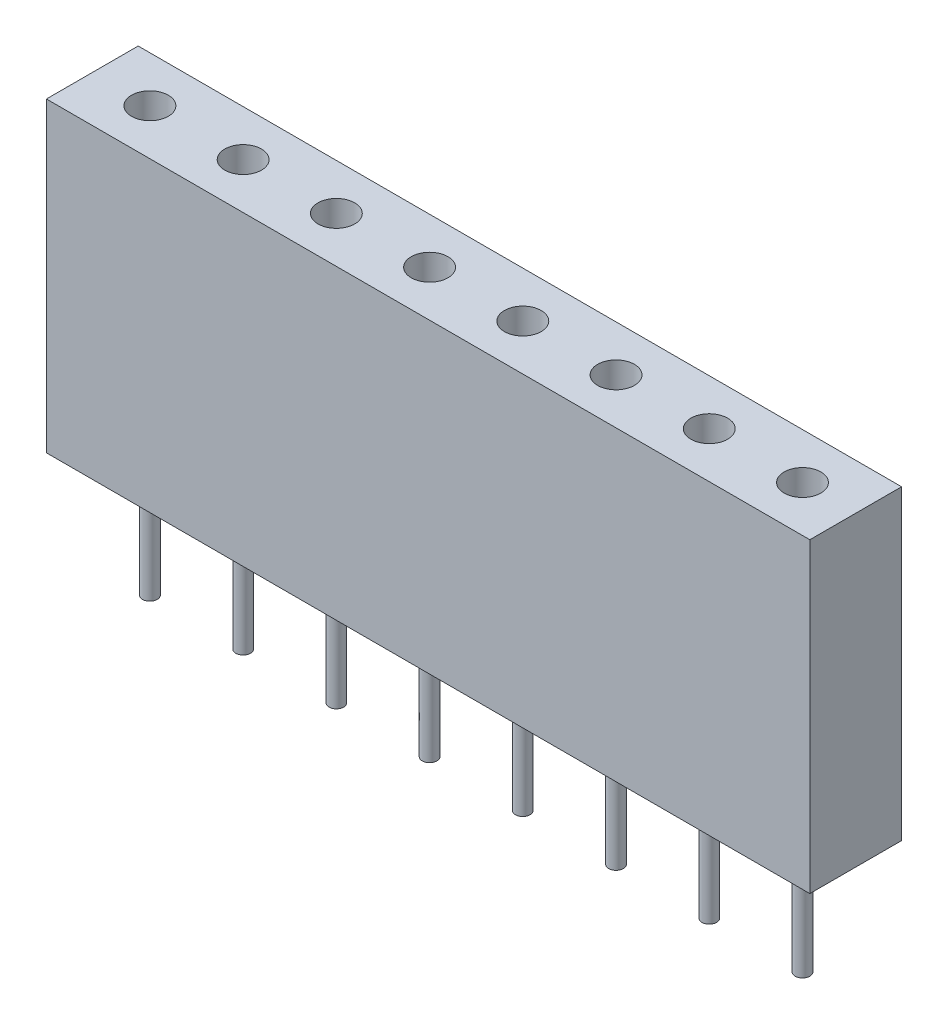
ISO-10303-21;
HEADER;
FILE_DESCRIPTION(('STEP AP214'),'2;1');
FILE_NAME('part.step','',(''),(''),'','','');
FILE_SCHEMA(('AUTOMOTIVE_DESIGN { 1 0 10303 214 1 1 1 1 }'));
ENDSEC;
DATA;
#1=APPLICATION_CONTEXT('core data for automotive mechanical design processes');
#2=APPLICATION_PROTOCOL_DEFINITION('international standard','automotive_design',2000,#1);
#3=PRODUCT_CONTEXT('',#1,'mechanical');
#4=PRODUCT('Part','Part','',(#3));
#5=PRODUCT_RELATED_PRODUCT_CATEGORY('part','',(#4));
#6=PRODUCT_DEFINITION_FORMATION('','',#4);
#7=PRODUCT_DEFINITION_CONTEXT('part definition',#1,'design');
#8=PRODUCT_DEFINITION('design','',#6,#7);
#9=PRODUCT_DEFINITION_SHAPE('','',#8);
#10=(LENGTH_UNIT() NAMED_UNIT(*) SI_UNIT(.MILLI.,.METRE.));
#11=(NAMED_UNIT(*) PLANE_ANGLE_UNIT() SI_UNIT($,.RADIAN.));
#12=(NAMED_UNIT(*) SI_UNIT($,.STERADIAN.) SOLID_ANGLE_UNIT());
#13=UNCERTAINTY_MEASURE_WITH_UNIT(LENGTH_MEASURE(1.E-05),#10,'distance_accuracy_value','');
#14=(GEOMETRIC_REPRESENTATION_CONTEXT(3) GLOBAL_UNCERTAINTY_ASSIGNED_CONTEXT((#13)) GLOBAL_UNIT_ASSIGNED_CONTEXT((#10,
#11,#12)) REPRESENTATION_CONTEXT('',''));
#15=CARTESIAN_POINT('',(0.,0.,0.));
#16=DIRECTION('',(0.,0.,1.));
#17=DIRECTION('',(1.,0.,0.));
#18=AXIS2_PLACEMENT_3D('',#15,#16,#17);
#19=CARTESIAN_POINT('',(10.4,8.35,1.25));
#20=DIRECTION('',(-1.,0.,0.));
#21=DIRECTION('',(0.,0.,1.));
#22=AXIS2_PLACEMENT_3D('',#19,#20,#21);
#23=PLANE('',#22);
#24=DIRECTION('',(0.,0.,-1.));
#25=VECTOR('',#24,1.);
#26=CARTESIAN_POINT('',(10.4,0.,1.25));
#27=LINE('',#26,#25);
#28=CARTESIAN_POINT('',(10.4,0.,1.25));
#29=VERTEX_POINT('',#28);
#30=CARTESIAN_POINT('',(10.4,0.,-1.25));
#31=VERTEX_POINT('',#30);
#32=EDGE_CURVE('E113',#29,#31,#27,.T.);
#33=ORIENTED_EDGE('',*,*,#32,.T.);
#34=DIRECTION('',(0.,-1.,0.));
#35=VECTOR('',#34,1.);
#36=CARTESIAN_POINT('',(10.4,8.35,-1.25));
#37=LINE('',#36,#35);
#38=CARTESIAN_POINT('',(10.4,8.35,-1.25));
#39=VERTEX_POINT('',#38);
#40=EDGE_CURVE('E11',#39,#31,#37,.T.);
#41=ORIENTED_EDGE('',*,*,#40,.F.);
#42=DIRECTION('',(0.,0.,-1.));
#43=VECTOR('',#42,1.);
#44=CARTESIAN_POINT('',(10.4,8.35,1.25));
#45=LINE('',#44,#43);
#46=CARTESIAN_POINT('',(10.4,8.35,1.25));
#47=VERTEX_POINT('',#46);
#48=EDGE_CURVE('E97',#47,#39,#45,.T.);
#49=ORIENTED_EDGE('',*,*,#48,.F.);
#50=DIRECTION('',(0.,-1.,0.));
#51=VECTOR('',#50,1.);
#52=CARTESIAN_POINT('',(10.4,8.35,1.25));
#53=LINE('',#52,#51);
#54=EDGE_CURVE('E109',#47,#29,#53,.T.);
#55=ORIENTED_EDGE('',*,*,#54,.T.);
#56=EDGE_LOOP('',(#33,#41,#49,#55));
#57=FACE_BOUND('',#56,.T.);
#58=ADVANCED_FACE('F45',(#57),#23,.F.);
#59=CARTESIAN_POINT('',(-10.4,8.35,-1.25));
#60=DIRECTION('',(0.,0.,1.));
#61=DIRECTION('',(1.,0.,0.));
#62=AXIS2_PLACEMENT_3D('',#59,#60,#61);
#63=PLANE('',#62);
#64=DIRECTION('',(-1.,0.,0.));
#65=VECTOR('',#64,1.);
#66=CARTESIAN_POINT('',(-10.4,0.,-1.25));
#67=LINE('',#66,#65);
#68=CARTESIAN_POINT('',(-10.4,0.,-1.25));
#69=VERTEX_POINT('',#68);
#70=EDGE_CURVE('E102',#31,#69,#67,.T.);
#71=ORIENTED_EDGE('',*,*,#70,.T.);
#72=DIRECTION('',(0.,-1.,0.));
#73=VECTOR('',#72,1.);
#74=CARTESIAN_POINT('',(-10.4,8.35,-1.25));
#75=LINE('',#74,#73);
#76=CARTESIAN_POINT('',(-10.4,8.35,-1.25));
#77=VERTEX_POINT('',#76);
#78=EDGE_CURVE('E54',#77,#69,#75,.T.);
#79=ORIENTED_EDGE('',*,*,#78,.F.);
#80=DIRECTION('',(-1.,0.,0.));
#81=VECTOR('',#80,1.);
#82=CARTESIAN_POINT('',(-10.4,8.35,-1.25));
#83=LINE('',#82,#81);
#84=EDGE_CURVE('E92',#39,#77,#83,.T.);
#85=ORIENTED_EDGE('',*,*,#84,.F.);
#86=ORIENTED_EDGE('',*,*,#40,.T.);
#87=EDGE_LOOP('',(#71,#79,#85,#86));
#88=FACE_BOUND('',#87,.T.);
#89=ADVANCED_FACE('F101',(#88),#63,.F.);
#90=CARTESIAN_POINT('',(-10.4,8.35,1.25));
#91=DIRECTION('',(1.,0.,0.));
#92=DIRECTION('',(0.,0.,-1.));
#93=AXIS2_PLACEMENT_3D('',#90,#91,#92);
#94=PLANE('',#93);
#95=DIRECTION('',(0.,0.,1.));
#96=VECTOR('',#95,1.);
#97=CARTESIAN_POINT('',(-10.4,0.,1.25));
#98=LINE('',#97,#96);
#99=CARTESIAN_POINT('',(-10.4,0.,1.25));
#100=VERTEX_POINT('',#99);
#101=EDGE_CURVE('E79',#69,#100,#98,.T.);
#102=ORIENTED_EDGE('',*,*,#101,.T.);
#103=DIRECTION('',(0.,-1.,0.));
#104=VECTOR('',#103,1.);
#105=CARTESIAN_POINT('',(-10.4,8.35,1.25));
#106=LINE('',#105,#104);
#107=CARTESIAN_POINT('',(-10.4,8.35,1.25));
#108=VERTEX_POINT('',#107);
#109=EDGE_CURVE('E104',#108,#100,#106,.T.);
#110=ORIENTED_EDGE('',*,*,#109,.F.);
#111=DIRECTION('',(0.,0.,1.));
#112=VECTOR('',#111,1.);
#113=CARTESIAN_POINT('',(-10.4,8.35,1.25));
#114=LINE('',#113,#112);
#115=EDGE_CURVE('E95',#77,#108,#114,.T.);
#116=ORIENTED_EDGE('',*,*,#115,.F.);
#117=ORIENTED_EDGE('',*,*,#78,.T.);
#118=EDGE_LOOP('',(#102,#110,#116,#117));
#119=FACE_BOUND('',#118,.T.);
#120=ADVANCED_FACE('F105',(#119),#94,.F.);
#121=CARTESIAN_POINT('',(-10.4,8.35,1.25));
#122=DIRECTION('',(0.,0.,-1.));
#123=DIRECTION('',(-1.,0.,0.));
#124=AXIS2_PLACEMENT_3D('',#121,#122,#123);
#125=PLANE('',#124);
#126=DIRECTION('',(1.,0.,0.));
#127=VECTOR('',#126,1.);
#128=CARTESIAN_POINT('',(-10.4,0.,1.25));
#129=LINE('',#128,#127);
#130=EDGE_CURVE('E85',#100,#29,#129,.T.);
#131=ORIENTED_EDGE('',*,*,#130,.T.);
#132=ORIENTED_EDGE('',*,*,#54,.F.);
#133=DIRECTION('',(1.,0.,0.));
#134=VECTOR('',#133,1.);
#135=CARTESIAN_POINT('',(-10.4,8.35,1.25));
#136=LINE('',#135,#134);
#137=EDGE_CURVE('E62',#108,#47,#136,.T.);
#138=ORIENTED_EDGE('',*,*,#137,.F.);
#139=ORIENTED_EDGE('',*,*,#109,.T.);
#140=EDGE_LOOP('',(#131,#132,#138,#139));
#141=FACE_BOUND('',#140,.T.);
#142=ADVANCED_FACE('F127',(#141),#125,.F.);
#143=CARTESIAN_POINT('',(0.,8.35,0.));
#144=DIRECTION('',(0.,-1.,0.));
#145=DIRECTION('',(0.,0.,-1.));
#146=AXIS2_PLACEMENT_3D('',#143,#144,#145);
#147=PLANE('',#146);
#148=CARTESIAN_POINT('',(8.95,8.35,0.));
#149=DIRECTION('',(0.,1.,0.));
#150=DIRECTION('',(0.,0.,1.));
#151=AXIS2_PLACEMENT_3D('',#148,#149,#150);
#152=CIRCLE('',#151,0.500000000000001);
#153=CARTESIAN_POINT('',(8.95,8.35,0.500000000000001));
#154=VERTEX_POINT('',#153);
#155=EDGE_CURVE('E201',#154,#154,#152,.T.);
#156=ORIENTED_EDGE('',*,*,#155,.F.);
#157=EDGE_LOOP('',(#156));
#158=FACE_BOUND('',#157,.T.);
#159=CARTESIAN_POINT('',(6.41,8.35,0.));
#160=DIRECTION('',(0.,1.,0.));
#161=DIRECTION('',(0.,0.,1.));
#162=AXIS2_PLACEMENT_3D('',#159,#160,#161);
#163=CIRCLE('',#162,0.500000000000001);
#164=CARTESIAN_POINT('',(6.41,8.35,0.500000000000001));
#165=VERTEX_POINT('',#164);
#166=EDGE_CURVE('E193',#165,#165,#163,.T.);
#167=ORIENTED_EDGE('',*,*,#166,.F.);
#168=EDGE_LOOP('',(#167));
#169=FACE_BOUND('',#168,.T.);
#170=CARTESIAN_POINT('',(3.87000000000001,8.35,0.));
#171=DIRECTION('',(0.,1.,0.));
#172=DIRECTION('',(0.,0.,1.));
#173=AXIS2_PLACEMENT_3D('',#170,#171,#172);
#174=CIRCLE('',#173,0.500000000000001);
#175=CARTESIAN_POINT('',(3.87000000000001,8.35,0.500000000000001));
#176=VERTEX_POINT('',#175);
#177=EDGE_CURVE('E185',#176,#176,#174,.T.);
#178=ORIENTED_EDGE('',*,*,#177,.F.);
#179=EDGE_LOOP('',(#178));
#180=FACE_BOUND('',#179,.T.);
#181=CARTESIAN_POINT('',(1.33,8.35,0.));
#182=DIRECTION('',(0.,1.,0.));
#183=DIRECTION('',(0.,0.,1.));
#184=AXIS2_PLACEMENT_3D('',#181,#182,#183);
#185=CIRCLE('',#184,0.500000000000001);
#186=CARTESIAN_POINT('',(1.33,8.35,0.500000000000001));
#187=VERTEX_POINT('',#186);
#188=EDGE_CURVE('E177',#187,#187,#185,.T.);
#189=ORIENTED_EDGE('',*,*,#188,.F.);
#190=EDGE_LOOP('',(#189));
#191=FACE_BOUND('',#190,.T.);
#192=CARTESIAN_POINT('',(-1.21,8.35,0.));
#193=DIRECTION('',(0.,1.,0.));
#194=DIRECTION('',(0.,0.,1.));
#195=AXIS2_PLACEMENT_3D('',#192,#193,#194);
#196=CIRCLE('',#195,0.500000000000001);
#197=CARTESIAN_POINT('',(-1.21,8.35,0.500000000000001));
#198=VERTEX_POINT('',#197);
#199=EDGE_CURVE('E169',#198,#198,#196,.T.);
#200=ORIENTED_EDGE('',*,*,#199,.F.);
#201=EDGE_LOOP('',(#200));
#202=FACE_BOUND('',#201,.T.);
#203=CARTESIAN_POINT('',(-3.75,8.35,0.));
#204=DIRECTION('',(0.,1.,0.));
#205=DIRECTION('',(0.,0.,1.));
#206=AXIS2_PLACEMENT_3D('',#203,#204,#205);
#207=CIRCLE('',#206,0.500000000000001);
#208=CARTESIAN_POINT('',(-3.75,8.35,0.500000000000001));
#209=VERTEX_POINT('',#208);
#210=EDGE_CURVE('E161',#209,#209,#207,.T.);
#211=ORIENTED_EDGE('',*,*,#210,.F.);
#212=EDGE_LOOP('',(#211));
#213=FACE_BOUND('',#212,.T.);
#214=CARTESIAN_POINT('',(-6.29,8.35,0.));
#215=DIRECTION('',(0.,1.,0.));
#216=DIRECTION('',(0.,0.,1.));
#217=AXIS2_PLACEMENT_3D('',#214,#215,#216);
#218=CIRCLE('',#217,0.500000000000001);
#219=CARTESIAN_POINT('',(-6.29,8.35,0.500000000000001));
#220=VERTEX_POINT('',#219);
#221=EDGE_CURVE('E153',#220,#220,#218,.T.);
#222=ORIENTED_EDGE('',*,*,#221,.F.);
#223=EDGE_LOOP('',(#222));
#224=FACE_BOUND('',#223,.T.);
#225=CARTESIAN_POINT('',(-8.83,8.35,0.));
#226=DIRECTION('',(0.,1.,0.));
#227=DIRECTION('',(0.,0.,1.));
#228=AXIS2_PLACEMENT_3D('',#225,#226,#227);
#229=CIRCLE('',#228,0.500000000000001);
#230=CARTESIAN_POINT('',(-8.83,8.35,0.500000000000001));
#231=VERTEX_POINT('',#230);
#232=EDGE_CURVE('E134',#231,#231,#229,.T.);
#233=ORIENTED_EDGE('',*,*,#232,.F.);
#234=EDGE_LOOP('',(#233));
#235=FACE_BOUND('',#234,.T.);
#236=ORIENTED_EDGE('',*,*,#48,.T.);
#237=ORIENTED_EDGE('',*,*,#84,.T.);
#238=ORIENTED_EDGE('',*,*,#115,.T.);
#239=ORIENTED_EDGE('',*,*,#137,.T.);
#240=EDGE_LOOP('',(#236,#237,#238,#239));
#241=FACE_BOUND('',#240,.T.);
#242=ADVANCED_FACE('F93',(#158,#169,#180,#191,#202,#213,#224,#235,#241),#147,.F.);
#243=CARTESIAN_POINT('',(0.,0.,0.));
#244=DIRECTION('',(0.,-1.,0.));
#245=DIRECTION('',(0.,0.,-1.));
#246=AXIS2_PLACEMENT_3D('',#243,#244,#245);
#247=PLANE('',#246);
#248=CARTESIAN_POINT('',(8.95,0.,0.));
#249=DIRECTION('',(0.,-1.,0.));
#250=DIRECTION('',(0.,0.,-1.));
#251=AXIS2_PLACEMENT_3D('',#248,#249,#250);
#252=CIRCLE('',#251,0.200000000000001);
#253=CARTESIAN_POINT('',(8.95,0.,-0.200000000000001));
#254=VERTEX_POINT('',#253);
#255=EDGE_CURVE('E254',#254,#254,#252,.T.);
#256=ORIENTED_EDGE('',*,*,#255,.F.);
#257=EDGE_LOOP('',(#256));
#258=FACE_BOUND('',#257,.T.);
#259=CARTESIAN_POINT('',(6.41,0.,0.));
#260=DIRECTION('',(0.,-1.,0.));
#261=DIRECTION('',(0.,0.,-1.));
#262=AXIS2_PLACEMENT_3D('',#259,#260,#261);
#263=CIRCLE('',#262,0.200000000000001);
#264=CARTESIAN_POINT('',(6.41,0.,-0.200000000000001));
#265=VERTEX_POINT('',#264);
#266=EDGE_CURVE('E246',#265,#265,#263,.T.);
#267=ORIENTED_EDGE('',*,*,#266,.F.);
#268=EDGE_LOOP('',(#267));
#269=FACE_BOUND('',#268,.T.);
#270=CARTESIAN_POINT('',(3.87000000000001,0.,0.));
#271=DIRECTION('',(0.,-1.,0.));
#272=DIRECTION('',(0.,0.,-1.));
#273=AXIS2_PLACEMENT_3D('',#270,#271,#272);
#274=CIRCLE('',#273,0.200000000000001);
#275=CARTESIAN_POINT('',(3.87000000000001,0.,-0.200000000000001));
#276=VERTEX_POINT('',#275);
#277=EDGE_CURVE('E238',#276,#276,#274,.T.);
#278=ORIENTED_EDGE('',*,*,#277,.F.);
#279=EDGE_LOOP('',(#278));
#280=FACE_BOUND('',#279,.T.);
#281=CARTESIAN_POINT('',(1.33,0.,0.));
#282=DIRECTION('',(0.,-1.,0.));
#283=DIRECTION('',(0.,0.,-1.));
#284=AXIS2_PLACEMENT_3D('',#281,#282,#283);
#285=CIRCLE('',#284,0.200000000000001);
#286=CARTESIAN_POINT('',(1.33,0.,-0.200000000000001));
#287=VERTEX_POINT('',#286);
#288=EDGE_CURVE('E230',#287,#287,#285,.T.);
#289=ORIENTED_EDGE('',*,*,#288,.F.);
#290=EDGE_LOOP('',(#289));
#291=FACE_BOUND('',#290,.T.);
#292=CARTESIAN_POINT('',(-1.21,0.,0.));
#293=DIRECTION('',(0.,-1.,0.));
#294=DIRECTION('',(0.,0.,-1.));
#295=AXIS2_PLACEMENT_3D('',#292,#293,#294);
#296=CIRCLE('',#295,0.200000000000001);
#297=CARTESIAN_POINT('',(-1.21,0.,-0.200000000000001));
#298=VERTEX_POINT('',#297);
#299=EDGE_CURVE('E222',#298,#298,#296,.T.);
#300=ORIENTED_EDGE('',*,*,#299,.F.);
#301=EDGE_LOOP('',(#300));
#302=FACE_BOUND('',#301,.T.);
#303=CARTESIAN_POINT('',(-3.75,0.,0.));
#304=DIRECTION('',(0.,-1.,0.));
#305=DIRECTION('',(0.,0.,-1.));
#306=AXIS2_PLACEMENT_3D('',#303,#304,#305);
#307=CIRCLE('',#306,0.200000000000001);
#308=CARTESIAN_POINT('',(-3.75,0.,-0.200000000000001));
#309=VERTEX_POINT('',#308);
#310=EDGE_CURVE('E214',#309,#309,#307,.T.);
#311=ORIENTED_EDGE('',*,*,#310,.F.);
#312=EDGE_LOOP('',(#311));
#313=FACE_BOUND('',#312,.T.);
#314=CARTESIAN_POINT('',(-6.29,0.,0.));
#315=DIRECTION('',(0.,-1.,0.));
#316=DIRECTION('',(0.,0.,-1.));
#317=AXIS2_PLACEMENT_3D('',#314,#315,#316);
#318=CIRCLE('',#317,0.200000000000001);
#319=CARTESIAN_POINT('',(-6.29,0.,-0.200000000000001));
#320=VERTEX_POINT('',#319);
#321=EDGE_CURVE('E206',#320,#320,#318,.T.);
#322=ORIENTED_EDGE('',*,*,#321,.F.);
#323=EDGE_LOOP('',(#322));
#324=FACE_BOUND('',#323,.T.);
#325=CARTESIAN_POINT('',(-8.83,0.,0.));
#326=DIRECTION('',(0.,-1.,0.));
#327=DIRECTION('',(0.,0.,-1.));
#328=AXIS2_PLACEMENT_3D('',#325,#326,#327);
#329=CIRCLE('',#328,0.200000000000001);
#330=CARTESIAN_POINT('',(-8.83,0.,-0.200000000000001));
#331=VERTEX_POINT('',#330);
#332=EDGE_CURVE('E142',#331,#331,#329,.T.);
#333=ORIENTED_EDGE('',*,*,#332,.F.);
#334=EDGE_LOOP('',(#333));
#335=FACE_BOUND('',#334,.T.);
#336=ORIENTED_EDGE('',*,*,#32,.F.);
#337=ORIENTED_EDGE('',*,*,#130,.F.);
#338=ORIENTED_EDGE('',*,*,#101,.F.);
#339=ORIENTED_EDGE('',*,*,#70,.F.);
#340=EDGE_LOOP('',(#336,#337,#338,#339));
#341=FACE_BOUND('',#340,.T.);
#342=ADVANCED_FACE('F130',(#258,#269,#280,#291,#302,#313,#324,#335,#341),#247,.T.);
#343=CARTESIAN_POINT('',(-8.83,5.35,0.));
#344=DIRECTION('',(0.,1.,0.));
#345=DIRECTION('',(0.,0.,1.));
#346=AXIS2_PLACEMENT_3D('',#343,#344,#345);
#347=CYLINDRICAL_SURFACE('',#346,0.500000000000001);
#348=CARTESIAN_POINT('',(-8.83,5.35,0.));
#349=DIRECTION('',(0.,1.,0.));
#350=DIRECTION('',(0.,0.,1.));
#351=AXIS2_PLACEMENT_3D('',#348,#349,#350);
#352=CIRCLE('',#351,0.500000000000001);
#353=CARTESIAN_POINT('',(-8.83,5.35,0.500000000000001));
#354=VERTEX_POINT('',#353);
#355=EDGE_CURVE('E117',#354,#354,#352,.T.);
#356=ORIENTED_EDGE('',*,*,#355,.F.);
#357=EDGE_LOOP('',(#356));
#358=FACE_BOUND('',#357,.T.);
#359=ORIENTED_EDGE('',*,*,#232,.T.);
#360=EDGE_LOOP('',(#359));
#361=FACE_BOUND('',#360,.T.);
#362=ADVANCED_FACE('F273',(#358,#361),#347,.F.);
#363=CARTESIAN_POINT('',(-8.83,5.35,0.));
#364=DIRECTION('',(0.,1.,0.));
#365=DIRECTION('',(0.,0.,1.));
#366=AXIS2_PLACEMENT_3D('',#363,#364,#365);
#367=PLANE('',#366);
#368=ORIENTED_EDGE('',*,*,#355,.T.);
#369=EDGE_LOOP('',(#368));
#370=FACE_BOUND('',#369,.T.);
#371=ADVANCED_FACE('F292',(#370),#367,.T.);
#372=CARTESIAN_POINT('',(-8.83,-3.2,0.));
#373=DIRECTION('',(0.,1.,0.));
#374=DIRECTION('',(0.,0.,1.));
#375=AXIS2_PLACEMENT_3D('',#372,#373,#374);
#376=CYLINDRICAL_SURFACE('',#375,0.200000000000001);
#377=CARTESIAN_POINT('',(-8.83,-3.2,0.));
#378=DIRECTION('',(0.,-1.,0.));
#379=DIRECTION('',(0.,0.,-1.));
#380=AXIS2_PLACEMENT_3D('',#377,#378,#379);
#381=CIRCLE('',#380,0.200000000000001);
#382=CARTESIAN_POINT('',(-8.83,-3.2,-0.200000000000001));
#383=VERTEX_POINT('',#382);
#384=EDGE_CURVE('E138',#383,#383,#381,.T.);
#385=ORIENTED_EDGE('',*,*,#384,.F.);
#386=EDGE_LOOP('',(#385));
#387=FACE_BOUND('',#386,.T.);
#388=ORIENTED_EDGE('',*,*,#332,.T.);
#389=EDGE_LOOP('',(#388));
#390=FACE_BOUND('',#389,.T.);
#391=ADVANCED_FACE('F289',(#387,#390),#376,.T.);
#392=CARTESIAN_POINT('',(-8.83,-3.2,0.));
#393=DIRECTION('',(0.,-1.,0.));
#394=DIRECTION('',(0.,0.,-1.));
#395=AXIS2_PLACEMENT_3D('',#392,#393,#394);
#396=PLANE('',#395);
#397=ORIENTED_EDGE('',*,*,#384,.T.);
#398=EDGE_LOOP('',(#397));
#399=FACE_BOUND('',#398,.T.);
#400=ADVANCED_FACE('F291',(#399),#396,.T.);
#401=CARTESIAN_POINT('',(-6.29,5.35,0.));
#402=DIRECTION('',(0.,1.,0.));
#403=DIRECTION('',(0.,0.,1.));
#404=AXIS2_PLACEMENT_3D('',#401,#402,#403);
#405=CYLINDRICAL_SURFACE('',#404,0.500000000000001);
#406=CARTESIAN_POINT('',(-6.29,5.35,0.));
#407=DIRECTION('',(0.,1.,0.));
#408=DIRECTION('',(0.,0.,1.));
#409=AXIS2_PLACEMENT_3D('',#406,#407,#408);
#410=CIRCLE('',#409,0.500000000000001);
#411=CARTESIAN_POINT('',(-6.29,5.35,0.500000000000001));
#412=VERTEX_POINT('',#411);
#413=EDGE_CURVE('E146',#412,#412,#410,.T.);
#414=ORIENTED_EDGE('',*,*,#413,.F.);
#415=EDGE_LOOP('',(#414));
#416=FACE_BOUND('',#415,.T.);
#417=ORIENTED_EDGE('',*,*,#221,.T.);
#418=EDGE_LOOP('',(#417));
#419=FACE_BOUND('',#418,.T.);
#420=ADVANCED_FACE('F299',(#416,#419),#405,.F.);
#421=CARTESIAN_POINT('',(-6.29,5.35,0.));
#422=DIRECTION('',(0.,1.,0.));
#423=DIRECTION('',(0.,0.,1.));
#424=AXIS2_PLACEMENT_3D('',#421,#422,#423);
#425=PLANE('',#424);
#426=ORIENTED_EDGE('',*,*,#413,.T.);
#427=EDGE_LOOP('',(#426));
#428=FACE_BOUND('',#427,.T.);
#429=ADVANCED_FACE('F355',(#428),#425,.T.);
#430=CARTESIAN_POINT('',(-3.75,5.35,0.));
#431=DIRECTION('',(0.,1.,0.));
#432=DIRECTION('',(0.,0.,1.));
#433=AXIS2_PLACEMENT_3D('',#430,#431,#432);
#434=CYLINDRICAL_SURFACE('',#433,0.500000000000001);
#435=CARTESIAN_POINT('',(-3.75,5.35,0.));
#436=DIRECTION('',(0.,1.,0.));
#437=DIRECTION('',(0.,0.,1.));
#438=AXIS2_PLACEMENT_3D('',#435,#436,#437);
#439=CIRCLE('',#438,0.500000000000001);
#440=CARTESIAN_POINT('',(-3.75,5.35,0.500000000000001));
#441=VERTEX_POINT('',#440);
#442=EDGE_CURVE('E157',#441,#441,#439,.T.);
#443=ORIENTED_EDGE('',*,*,#442,.F.);
#444=EDGE_LOOP('',(#443));
#445=FACE_BOUND('',#444,.T.);
#446=ORIENTED_EDGE('',*,*,#210,.T.);
#447=EDGE_LOOP('',(#446));
#448=FACE_BOUND('',#447,.T.);
#449=ADVANCED_FACE('F365',(#445,#448),#434,.F.);
#450=CARTESIAN_POINT('',(-3.75,5.35,0.));
#451=DIRECTION('',(0.,1.,0.));
#452=DIRECTION('',(0.,0.,1.));
#453=AXIS2_PLACEMENT_3D('',#450,#451,#452);
#454=PLANE('',#453);
#455=ORIENTED_EDGE('',*,*,#442,.T.);
#456=EDGE_LOOP('',(#455));
#457=FACE_BOUND('',#456,.T.);
#458=ADVANCED_FACE('F375',(#457),#454,.T.);
#459=CARTESIAN_POINT('',(-1.21,5.35,0.));
#460=DIRECTION('',(0.,1.,0.));
#461=DIRECTION('',(0.,0.,1.));
#462=AXIS2_PLACEMENT_3D('',#459,#460,#461);
#463=CYLINDRICAL_SURFACE('',#462,0.500000000000001);
#464=CARTESIAN_POINT('',(-1.21,5.35,0.));
#465=DIRECTION('',(0.,1.,0.));
#466=DIRECTION('',(0.,0.,1.));
#467=AXIS2_PLACEMENT_3D('',#464,#465,#466);
#468=CIRCLE('',#467,0.500000000000001);
#469=CARTESIAN_POINT('',(-1.21,5.35,0.500000000000001));
#470=VERTEX_POINT('',#469);
#471=EDGE_CURVE('E165',#470,#470,#468,.T.);
#472=ORIENTED_EDGE('',*,*,#471,.F.);
#473=EDGE_LOOP('',(#472));
#474=FACE_BOUND('',#473,.T.);
#475=ORIENTED_EDGE('',*,*,#199,.T.);
#476=EDGE_LOOP('',(#475));
#477=FACE_BOUND('',#476,.T.);
#478=ADVANCED_FACE('F385',(#474,#477),#463,.F.);
#479=CARTESIAN_POINT('',(-1.21,5.35,0.));
#480=DIRECTION('',(0.,1.,0.));
#481=DIRECTION('',(0.,0.,1.));
#482=AXIS2_PLACEMENT_3D('',#479,#480,#481);
#483=PLANE('',#482);
#484=ORIENTED_EDGE('',*,*,#471,.T.);
#485=EDGE_LOOP('',(#484));
#486=FACE_BOUND('',#485,.T.);
#487=ADVANCED_FACE('F395',(#486),#483,.T.);
#488=CARTESIAN_POINT('',(1.33,5.35,0.));
#489=DIRECTION('',(0.,1.,0.));
#490=DIRECTION('',(0.,0.,1.));
#491=AXIS2_PLACEMENT_3D('',#488,#489,#490);
#492=CYLINDRICAL_SURFACE('',#491,0.500000000000001);
#493=CARTESIAN_POINT('',(1.33,5.35,0.));
#494=DIRECTION('',(0.,1.,0.));
#495=DIRECTION('',(0.,0.,1.));
#496=AXIS2_PLACEMENT_3D('',#493,#494,#495);
#497=CIRCLE('',#496,0.500000000000001);
#498=CARTESIAN_POINT('',(1.33,5.35,0.500000000000001));
#499=VERTEX_POINT('',#498);
#500=EDGE_CURVE('E173',#499,#499,#497,.T.);
#501=ORIENTED_EDGE('',*,*,#500,.F.);
#502=EDGE_LOOP('',(#501));
#503=FACE_BOUND('',#502,.T.);
#504=ORIENTED_EDGE('',*,*,#188,.T.);
#505=EDGE_LOOP('',(#504));
#506=FACE_BOUND('',#505,.T.);
#507=ADVANCED_FACE('F405',(#503,#506),#492,.F.);
#508=CARTESIAN_POINT('',(1.33,5.35,0.));
#509=DIRECTION('',(0.,1.,0.));
#510=DIRECTION('',(0.,0.,1.));
#511=AXIS2_PLACEMENT_3D('',#508,#509,#510);
#512=PLANE('',#511);
#513=ORIENTED_EDGE('',*,*,#500,.T.);
#514=EDGE_LOOP('',(#513));
#515=FACE_BOUND('',#514,.T.);
#516=ADVANCED_FACE('F415',(#515),#512,.T.);
#517=CARTESIAN_POINT('',(3.87000000000001,5.35,0.));
#518=DIRECTION('',(0.,1.,0.));
#519=DIRECTION('',(0.,0.,1.));
#520=AXIS2_PLACEMENT_3D('',#517,#518,#519);
#521=CYLINDRICAL_SURFACE('',#520,0.500000000000001);
#522=CARTESIAN_POINT('',(3.87000000000001,5.35,0.));
#523=DIRECTION('',(0.,1.,0.));
#524=DIRECTION('',(0.,0.,1.));
#525=AXIS2_PLACEMENT_3D('',#522,#523,#524);
#526=CIRCLE('',#525,0.500000000000001);
#527=CARTESIAN_POINT('',(3.87000000000001,5.35,0.500000000000001));
#528=VERTEX_POINT('',#527);
#529=EDGE_CURVE('E181',#528,#528,#526,.T.);
#530=ORIENTED_EDGE('',*,*,#529,.F.);
#531=EDGE_LOOP('',(#530));
#532=FACE_BOUND('',#531,.T.);
#533=ORIENTED_EDGE('',*,*,#177,.T.);
#534=EDGE_LOOP('',(#533));
#535=FACE_BOUND('',#534,.T.);
#536=ADVANCED_FACE('F425',(#532,#535),#521,.F.);
#537=CARTESIAN_POINT('',(3.87000000000001,5.35,0.));
#538=DIRECTION('',(0.,1.,0.));
#539=DIRECTION('',(0.,0.,1.));
#540=AXIS2_PLACEMENT_3D('',#537,#538,#539);
#541=PLANE('',#540);
#542=ORIENTED_EDGE('',*,*,#529,.T.);
#543=EDGE_LOOP('',(#542));
#544=FACE_BOUND('',#543,.T.);
#545=ADVANCED_FACE('F435',(#544),#541,.T.);
#546=CARTESIAN_POINT('',(6.41,5.35,0.));
#547=DIRECTION('',(0.,1.,0.));
#548=DIRECTION('',(0.,0.,1.));
#549=AXIS2_PLACEMENT_3D('',#546,#547,#548);
#550=CYLINDRICAL_SURFACE('',#549,0.500000000000001);
#551=CARTESIAN_POINT('',(6.41,5.35,0.));
#552=DIRECTION('',(0.,1.,0.));
#553=DIRECTION('',(0.,0.,1.));
#554=AXIS2_PLACEMENT_3D('',#551,#552,#553);
#555=CIRCLE('',#554,0.500000000000001);
#556=CARTESIAN_POINT('',(6.41,5.35,0.500000000000001));
#557=VERTEX_POINT('',#556);
#558=EDGE_CURVE('E189',#557,#557,#555,.T.);
#559=ORIENTED_EDGE('',*,*,#558,.F.);
#560=EDGE_LOOP('',(#559));
#561=FACE_BOUND('',#560,.T.);
#562=ORIENTED_EDGE('',*,*,#166,.T.);
#563=EDGE_LOOP('',(#562));
#564=FACE_BOUND('',#563,.T.);
#565=ADVANCED_FACE('F445',(#561,#564),#550,.F.);
#566=CARTESIAN_POINT('',(6.41,5.35,0.));
#567=DIRECTION('',(0.,1.,0.));
#568=DIRECTION('',(0.,0.,1.));
#569=AXIS2_PLACEMENT_3D('',#566,#567,#568);
#570=PLANE('',#569);
#571=ORIENTED_EDGE('',*,*,#558,.T.);
#572=EDGE_LOOP('',(#571));
#573=FACE_BOUND('',#572,.T.);
#574=ADVANCED_FACE('F455',(#573),#570,.T.);
#575=CARTESIAN_POINT('',(8.95,5.35,0.));
#576=DIRECTION('',(0.,1.,0.));
#577=DIRECTION('',(0.,0.,1.));
#578=AXIS2_PLACEMENT_3D('',#575,#576,#577);
#579=CYLINDRICAL_SURFACE('',#578,0.500000000000001);
#580=CARTESIAN_POINT('',(8.95,5.35,0.));
#581=DIRECTION('',(0.,1.,0.));
#582=DIRECTION('',(0.,0.,1.));
#583=AXIS2_PLACEMENT_3D('',#580,#581,#582);
#584=CIRCLE('',#583,0.500000000000001);
#585=CARTESIAN_POINT('',(8.95,5.35,0.500000000000001));
#586=VERTEX_POINT('',#585);
#587=EDGE_CURVE('E197',#586,#586,#584,.T.);
#588=ORIENTED_EDGE('',*,*,#587,.F.);
#589=EDGE_LOOP('',(#588));
#590=FACE_BOUND('',#589,.T.);
#591=ORIENTED_EDGE('',*,*,#155,.T.);
#592=EDGE_LOOP('',(#591));
#593=FACE_BOUND('',#592,.T.);
#594=ADVANCED_FACE('F465',(#590,#593),#579,.F.);
#595=CARTESIAN_POINT('',(8.95,5.35,0.));
#596=DIRECTION('',(0.,1.,0.));
#597=DIRECTION('',(0.,0.,1.));
#598=AXIS2_PLACEMENT_3D('',#595,#596,#597);
#599=PLANE('',#598);
#600=ORIENTED_EDGE('',*,*,#587,.T.);
#601=EDGE_LOOP('',(#600));
#602=FACE_BOUND('',#601,.T.);
#603=ADVANCED_FACE('F475',(#602),#599,.T.);
#604=CARTESIAN_POINT('',(-6.29,-3.2,0.));
#605=DIRECTION('',(0.,1.,0.));
#606=DIRECTION('',(0.,0.,1.));
#607=AXIS2_PLACEMENT_3D('',#604,#605,#606);
#608=CYLINDRICAL_SURFACE('',#607,0.200000000000001);
#609=CARTESIAN_POINT('',(-6.29,-3.2,0.));
#610=DIRECTION('',(0.,-1.,0.));
#611=DIRECTION('',(0.,0.,-1.));
#612=AXIS2_PLACEMENT_3D('',#609,#610,#611);
#613=CIRCLE('',#612,0.200000000000001);
#614=CARTESIAN_POINT('',(-6.29,-3.2,-0.200000000000001));
#615=VERTEX_POINT('',#614);
#616=EDGE_CURVE('E205',#615,#615,#613,.T.);
#617=ORIENTED_EDGE('',*,*,#616,.F.);
#618=EDGE_LOOP('',(#617));
#619=FACE_BOUND('',#618,.T.);
#620=ORIENTED_EDGE('',*,*,#321,.T.);
#621=EDGE_LOOP('',(#620));
#622=FACE_BOUND('',#621,.T.);
#623=ADVANCED_FACE('F485',(#619,#622),#608,.T.);
#624=CARTESIAN_POINT('',(-6.29,-3.2,0.));
#625=DIRECTION('',(0.,-1.,0.));
#626=DIRECTION('',(0.,0.,-1.));
#627=AXIS2_PLACEMENT_3D('',#624,#625,#626);
#628=PLANE('',#627);
#629=ORIENTED_EDGE('',*,*,#616,.T.);
#630=EDGE_LOOP('',(#629));
#631=FACE_BOUND('',#630,.T.);
#632=ADVANCED_FACE('F495',(#631),#628,.T.);
#633=CARTESIAN_POINT('',(-3.75,-3.2,0.));
#634=DIRECTION('',(0.,1.,0.));
#635=DIRECTION('',(0.,0.,1.));
#636=AXIS2_PLACEMENT_3D('',#633,#634,#635);
#637=CYLINDRICAL_SURFACE('',#636,0.200000000000001);
#638=CARTESIAN_POINT('',(-3.75,-3.2,0.));
#639=DIRECTION('',(0.,-1.,0.));
#640=DIRECTION('',(0.,0.,-1.));
#641=AXIS2_PLACEMENT_3D('',#638,#639,#640);
#642=CIRCLE('',#641,0.200000000000001);
#643=CARTESIAN_POINT('',(-3.75,-3.2,-0.200000000000001));
#644=VERTEX_POINT('',#643);
#645=EDGE_CURVE('E210',#644,#644,#642,.T.);
#646=ORIENTED_EDGE('',*,*,#645,.F.);
#647=EDGE_LOOP('',(#646));
#648=FACE_BOUND('',#647,.T.);
#649=ORIENTED_EDGE('',*,*,#310,.T.);
#650=EDGE_LOOP('',(#649));
#651=FACE_BOUND('',#650,.T.);
#652=ADVANCED_FACE('F505',(#648,#651),#637,.T.);
#653=CARTESIAN_POINT('',(-3.75,-3.2,0.));
#654=DIRECTION('',(0.,-1.,0.));
#655=DIRECTION('',(0.,0.,-1.));
#656=AXIS2_PLACEMENT_3D('',#653,#654,#655);
#657=PLANE('',#656);
#658=ORIENTED_EDGE('',*,*,#645,.T.);
#659=EDGE_LOOP('',(#658));
#660=FACE_BOUND('',#659,.T.);
#661=ADVANCED_FACE('F515',(#660),#657,.T.);
#662=CARTESIAN_POINT('',(-1.21,-3.2,0.));
#663=DIRECTION('',(0.,1.,0.));
#664=DIRECTION('',(0.,0.,1.));
#665=AXIS2_PLACEMENT_3D('',#662,#663,#664);
#666=CYLINDRICAL_SURFACE('',#665,0.200000000000001);
#667=CARTESIAN_POINT('',(-1.21,-3.2,0.));
#668=DIRECTION('',(0.,-1.,0.));
#669=DIRECTION('',(0.,0.,-1.));
#670=AXIS2_PLACEMENT_3D('',#667,#668,#669);
#671=CIRCLE('',#670,0.200000000000001);
#672=CARTESIAN_POINT('',(-1.21,-3.2,-0.200000000000001));
#673=VERTEX_POINT('',#672);
#674=EDGE_CURVE('E218',#673,#673,#671,.T.);
#675=ORIENTED_EDGE('',*,*,#674,.F.);
#676=EDGE_LOOP('',(#675));
#677=FACE_BOUND('',#676,.T.);
#678=ORIENTED_EDGE('',*,*,#299,.T.);
#679=EDGE_LOOP('',(#678));
#680=FACE_BOUND('',#679,.T.);
#681=ADVANCED_FACE('F525',(#677,#680),#666,.T.);
#682=CARTESIAN_POINT('',(-1.21,-3.2,0.));
#683=DIRECTION('',(0.,-1.,0.));
#684=DIRECTION('',(0.,0.,-1.));
#685=AXIS2_PLACEMENT_3D('',#682,#683,#684);
#686=PLANE('',#685);
#687=ORIENTED_EDGE('',*,*,#674,.T.);
#688=EDGE_LOOP('',(#687));
#689=FACE_BOUND('',#688,.T.);
#690=ADVANCED_FACE('F535',(#689),#686,.T.);
#691=CARTESIAN_POINT('',(1.33,-3.2,0.));
#692=DIRECTION('',(0.,1.,0.));
#693=DIRECTION('',(0.,0.,1.));
#694=AXIS2_PLACEMENT_3D('',#691,#692,#693);
#695=CYLINDRICAL_SURFACE('',#694,0.200000000000001);
#696=CARTESIAN_POINT('',(1.33,-3.2,0.));
#697=DIRECTION('',(0.,-1.,0.));
#698=DIRECTION('',(0.,0.,-1.));
#699=AXIS2_PLACEMENT_3D('',#696,#697,#698);
#700=CIRCLE('',#699,0.200000000000001);
#701=CARTESIAN_POINT('',(1.33,-3.2,-0.200000000000001));
#702=VERTEX_POINT('',#701);
#703=EDGE_CURVE('E226',#702,#702,#700,.T.);
#704=ORIENTED_EDGE('',*,*,#703,.F.);
#705=EDGE_LOOP('',(#704));
#706=FACE_BOUND('',#705,.T.);
#707=ORIENTED_EDGE('',*,*,#288,.T.);
#708=EDGE_LOOP('',(#707));
#709=FACE_BOUND('',#708,.T.);
#710=ADVANCED_FACE('F545',(#706,#709),#695,.T.);
#711=CARTESIAN_POINT('',(1.33,-3.2,0.));
#712=DIRECTION('',(0.,-1.,0.));
#713=DIRECTION('',(0.,0.,-1.));
#714=AXIS2_PLACEMENT_3D('',#711,#712,#713);
#715=PLANE('',#714);
#716=ORIENTED_EDGE('',*,*,#703,.T.);
#717=EDGE_LOOP('',(#716));
#718=FACE_BOUND('',#717,.T.);
#719=ADVANCED_FACE('F555',(#718),#715,.T.);
#720=CARTESIAN_POINT('',(3.87000000000001,-3.2,0.));
#721=DIRECTION('',(0.,1.,0.));
#722=DIRECTION('',(0.,0.,1.));
#723=AXIS2_PLACEMENT_3D('',#720,#721,#722);
#724=CYLINDRICAL_SURFACE('',#723,0.200000000000001);
#725=CARTESIAN_POINT('',(3.87000000000001,-3.2,0.));
#726=DIRECTION('',(0.,-1.,0.));
#727=DIRECTION('',(0.,0.,-1.));
#728=AXIS2_PLACEMENT_3D('',#725,#726,#727);
#729=CIRCLE('',#728,0.200000000000001);
#730=CARTESIAN_POINT('',(3.87000000000001,-3.2,-0.200000000000001));
#731=VERTEX_POINT('',#730);
#732=EDGE_CURVE('E234',#731,#731,#729,.T.);
#733=ORIENTED_EDGE('',*,*,#732,.F.);
#734=EDGE_LOOP('',(#733));
#735=FACE_BOUND('',#734,.T.);
#736=ORIENTED_EDGE('',*,*,#277,.T.);
#737=EDGE_LOOP('',(#736));
#738=FACE_BOUND('',#737,.T.);
#739=ADVANCED_FACE('F565',(#735,#738),#724,.T.);
#740=CARTESIAN_POINT('',(3.87000000000001,-3.2,0.));
#741=DIRECTION('',(0.,-1.,0.));
#742=DIRECTION('',(0.,0.,-1.));
#743=AXIS2_PLACEMENT_3D('',#740,#741,#742);
#744=PLANE('',#743);
#745=ORIENTED_EDGE('',*,*,#732,.T.);
#746=EDGE_LOOP('',(#745));
#747=FACE_BOUND('',#746,.T.);
#748=ADVANCED_FACE('F575',(#747),#744,.T.);
#749=CARTESIAN_POINT('',(6.41,-3.2,0.));
#750=DIRECTION('',(0.,1.,0.));
#751=DIRECTION('',(0.,0.,1.));
#752=AXIS2_PLACEMENT_3D('',#749,#750,#751);
#753=CYLINDRICAL_SURFACE('',#752,0.200000000000001);
#754=CARTESIAN_POINT('',(6.41,-3.2,0.));
#755=DIRECTION('',(0.,-1.,0.));
#756=DIRECTION('',(0.,0.,-1.));
#757=AXIS2_PLACEMENT_3D('',#754,#755,#756);
#758=CIRCLE('',#757,0.200000000000001);
#759=CARTESIAN_POINT('',(6.41,-3.2,-0.200000000000001));
#760=VERTEX_POINT('',#759);
#761=EDGE_CURVE('E242',#760,#760,#758,.T.);
#762=ORIENTED_EDGE('',*,*,#761,.F.);
#763=EDGE_LOOP('',(#762));
#764=FACE_BOUND('',#763,.T.);
#765=ORIENTED_EDGE('',*,*,#266,.T.);
#766=EDGE_LOOP('',(#765));
#767=FACE_BOUND('',#766,.T.);
#768=ADVANCED_FACE('F585',(#764,#767),#753,.T.);
#769=CARTESIAN_POINT('',(6.41,-3.2,0.));
#770=DIRECTION('',(0.,-1.,0.));
#771=DIRECTION('',(0.,0.,-1.));
#772=AXIS2_PLACEMENT_3D('',#769,#770,#771);
#773=PLANE('',#772);
#774=ORIENTED_EDGE('',*,*,#761,.T.);
#775=EDGE_LOOP('',(#774));
#776=FACE_BOUND('',#775,.T.);
#777=ADVANCED_FACE('F267',(#776),#773,.T.);
#778=CARTESIAN_POINT('',(8.95,-3.2,0.));
#779=DIRECTION('',(0.,1.,0.));
#780=DIRECTION('',(0.,0.,1.));
#781=AXIS2_PLACEMENT_3D('',#778,#779,#780);
#782=CYLINDRICAL_SURFACE('',#781,0.200000000000001);
#783=CARTESIAN_POINT('',(8.95,-3.2,0.));
#784=DIRECTION('',(0.,-1.,0.));
#785=DIRECTION('',(0.,0.,-1.));
#786=AXIS2_PLACEMENT_3D('',#783,#784,#785);
#787=CIRCLE('',#786,0.200000000000001);
#788=CARTESIAN_POINT('',(8.95,-3.2,-0.200000000000001));
#789=VERTEX_POINT('',#788);
#790=EDGE_CURVE('E250',#789,#789,#787,.T.);
#791=ORIENTED_EDGE('',*,*,#790,.F.);
#792=EDGE_LOOP('',(#791));
#793=FACE_BOUND('',#792,.T.);
#794=ORIENTED_EDGE('',*,*,#255,.T.);
#795=EDGE_LOOP('',(#794));
#796=FACE_BOUND('',#795,.T.);
#797=ADVANCED_FACE('F264',(#793,#796),#782,.T.);
#798=CARTESIAN_POINT('',(8.95,-3.2,0.));
#799=DIRECTION('',(0.,-1.,0.));
#800=DIRECTION('',(0.,0.,-1.));
#801=AXIS2_PLACEMENT_3D('',#798,#799,#800);
#802=PLANE('',#801);
#803=ORIENTED_EDGE('',*,*,#790,.T.);
#804=EDGE_LOOP('',(#803));
#805=FACE_BOUND('',#804,.T.);
#806=ADVANCED_FACE('F262',(#805),#802,.T.);
#807=CLOSED_SHELL('',(#58,#89,#120,#142,#242,#342,#362,#371,#391,#400,#420,#429,#449,#458,#478,
#487,#507,#516,#536,#545,#565,#574,#594,#603,#623,#632,#652,#661,#681,#690,#710,#719,#739,#748,
#768,#777,#797,#806));
#808=MANIFOLD_SOLID_BREP('B2',#807);
#809=ADVANCED_BREP_SHAPE_REPRESENTATION('',(#18,#808),#14);
#810=SHAPE_DEFINITION_REPRESENTATION(#9,#809);
ENDSEC;
END-ISO-10303-21;
